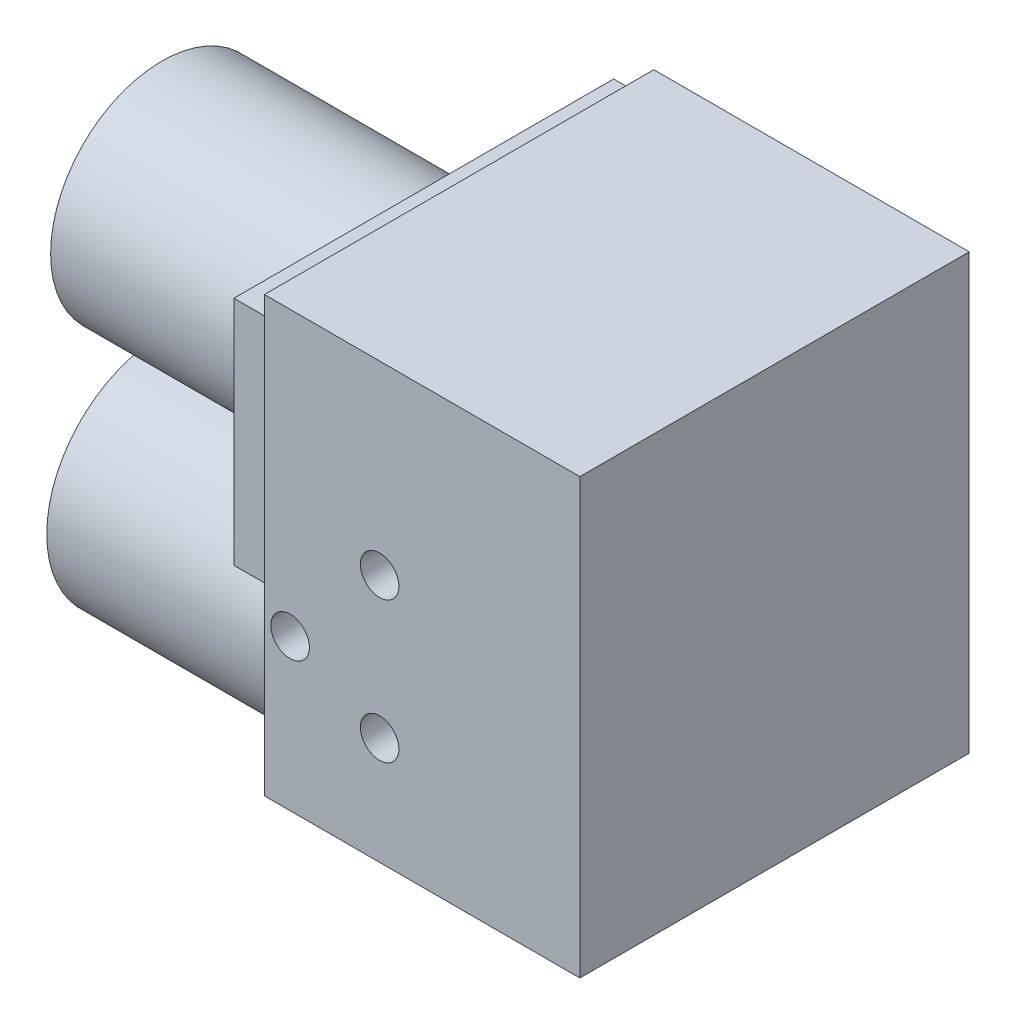
ISO-10303-21;
HEADER;
FILE_DESCRIPTION(('STEP AP214'),'2;1');
FILE_NAME('part.step','',(''),(''),'','','');
FILE_SCHEMA(('AUTOMOTIVE_DESIGN { 1 0 10303 214 1 1 1 1 }'));
ENDSEC;
DATA;
#1=APPLICATION_CONTEXT('core data for automotive mechanical design processes');
#2=APPLICATION_PROTOCOL_DEFINITION('international standard','automotive_design',2000,#1);
#3=PRODUCT_CONTEXT('',#1,'mechanical');
#4=PRODUCT('Part','Part','',(#3));
#5=PRODUCT_RELATED_PRODUCT_CATEGORY('part','',(#4));
#6=PRODUCT_DEFINITION_FORMATION('','',#4);
#7=PRODUCT_DEFINITION_CONTEXT('part definition',#1,'design');
#8=PRODUCT_DEFINITION('design','',#6,#7);
#9=PRODUCT_DEFINITION_SHAPE('','',#8);
#10=(LENGTH_UNIT() NAMED_UNIT(*) SI_UNIT(.MILLI.,.METRE.));
#11=(NAMED_UNIT(*) PLANE_ANGLE_UNIT() SI_UNIT($,.RADIAN.));
#12=(NAMED_UNIT(*) SI_UNIT($,.STERADIAN.) SOLID_ANGLE_UNIT());
#13=UNCERTAINTY_MEASURE_WITH_UNIT(LENGTH_MEASURE(1.E-05),#10,'distance_accuracy_value','');
#14=(GEOMETRIC_REPRESENTATION_CONTEXT(3) GLOBAL_UNCERTAINTY_ASSIGNED_CONTEXT((#13)) GLOBAL_UNIT_ASSIGNED_CONTEXT((#10,
#11,#12)) REPRESENTATION_CONTEXT('',''));
#15=CARTESIAN_POINT('',(0.,0.,0.));
#16=DIRECTION('',(0.,0.,1.));
#17=DIRECTION('',(1.,0.,0.));
#18=AXIS2_PLACEMENT_3D('',#15,#16,#17);
#19=CARTESIAN_POINT('',(-49.09,67.575,-65.6));
#20=DIRECTION('',(-1.,0.,0.));
#21=DIRECTION('',(0.,0.,1.));
#22=AXIS2_PLACEMENT_3D('',#19,#20,#21);
#23=PLANE('',#22);
#24=DIRECTION('',(0.,0.,1.));
#25=VECTOR('',#24,1.);
#26=CARTESIAN_POINT('',(-49.09,-67.575,-65.6));
#27=LINE('',#26,#25);
#28=CARTESIAN_POINT('',(-49.09,-67.575,-65.6));
#29=VERTEX_POINT('',#28);
#30=CARTESIAN_POINT('',(-49.09,-67.575,-31.6166490950575));
#31=VERTEX_POINT('',#30);
#32=EDGE_CURVE('E257',#29,#31,#27,.T.);
#33=ORIENTED_EDGE('',*,*,#32,.T.);
#34=CARTESIAN_POINT('',(-49.09,-50.675,0.));
#35=DIRECTION('',(-1.,0.,0.));
#36=DIRECTION('',(0.,0.,1.));
#37=AXIS2_PLACEMENT_3D('',#34,#35,#36);
#38=CIRCLE('',#37,35.85);
#39=CARTESIAN_POINT('',(-49.09,-67.575,31.6166490950575));
#40=VERTEX_POINT('',#39);
#41=EDGE_CURVE('E220',#40,#31,#38,.T.);
#42=ORIENTED_EDGE('',*,*,#41,.F.);
#43=CARTESIAN_POINT('',(-49.09,-67.575,55.6));
#44=VERTEX_POINT('',#43);
#45=EDGE_CURVE('E253',#40,#44,#27,.T.);
#46=ORIENTED_EDGE('',*,*,#45,.T.);
#47=DIRECTION('',(0.,-1.,0.));
#48=VECTOR('',#47,1.);
#49=CARTESIAN_POINT('',(-49.09,67.575,55.6));
#50=LINE('',#49,#48);
#51=CARTESIAN_POINT('',(-49.09,67.575,55.6));
#52=VERTEX_POINT('',#51);
#53=EDGE_CURVE('E230',#52,#44,#50,.T.);
#54=ORIENTED_EDGE('',*,*,#53,.F.);
#55=DIRECTION('',(0.,0.,1.));
#56=VECTOR('',#55,1.);
#57=CARTESIAN_POINT('',(-49.09,67.575,-65.6));
#58=LINE('',#57,#56);
#59=CARTESIAN_POINT('',(-49.09,67.575,-65.6));
#60=VERTEX_POINT('',#59);
#61=EDGE_CURVE('E11',#60,#52,#58,.T.);
#62=ORIENTED_EDGE('',*,*,#61,.F.);
#63=DIRECTION('',(0.,-1.,0.));
#64=VECTOR('',#63,1.);
#65=CARTESIAN_POINT('',(-49.09,67.575,-65.6));
#66=LINE('',#65,#64);
#67=EDGE_CURVE('E242',#60,#29,#66,.T.);
#68=ORIENTED_EDGE('',*,*,#67,.T.);
#69=EDGE_LOOP('',(#33,#42,#46,#54,#62,#68));
#70=FACE_BOUND('',#69,.T.);
#71=DIRECTION('',(0.,0.,1.));
#72=VECTOR('',#71,1.);
#73=CARTESIAN_POINT('',(-49.09,-11.675,-64.1));
#74=LINE('',#73,#72);
#75=CARTESIAN_POINT('',(-49.09,-11.675,-64.1));
#76=VERTEX_POINT('',#75);
#77=CARTESIAN_POINT('',(-49.09,-11.675,54.1));
#78=VERTEX_POINT('',#77);
#79=EDGE_CURVE('E177',#76,#78,#74,.T.);
#80=ORIENTED_EDGE('',*,*,#79,.F.);
#81=DIRECTION('',(0.,-1.,0.));
#82=VECTOR('',#81,1.);
#83=CARTESIAN_POINT('',(-49.09,60.325,-64.1));
#84=LINE('',#83,#82);
#85=CARTESIAN_POINT('',(-49.09,60.325,-64.1));
#86=VERTEX_POINT('',#85);
#87=EDGE_CURVE('E163',#86,#76,#84,.T.);
#88=ORIENTED_EDGE('',*,*,#87,.F.);
#89=DIRECTION('',(0.,0.,-1.));
#90=VECTOR('',#89,1.);
#91=CARTESIAN_POINT('',(-49.09,60.325,-64.1));
#92=LINE('',#91,#90);
#93=CARTESIAN_POINT('',(-49.09,60.325,54.1));
#94=VERTEX_POINT('',#93);
#95=EDGE_CURVE('E168',#94,#86,#92,.T.);
#96=ORIENTED_EDGE('',*,*,#95,.F.);
#97=DIRECTION('',(0.,1.,0.));
#98=VECTOR('',#97,1.);
#99=CARTESIAN_POINT('',(-49.09,60.325,54.1));
#100=LINE('',#99,#98);
#101=EDGE_CURVE('E179',#78,#94,#100,.T.);
#102=ORIENTED_EDGE('',*,*,#101,.F.);
#103=EDGE_LOOP('',(#80,#88,#96,#102));
#104=FACE_BOUND('',#103,.T.);
#105=ADVANCED_FACE('F33',(#70,#104),#23,.T.);
#106=CARTESIAN_POINT('',(-49.09,67.575,-65.6));
#107=DIRECTION('',(0.,1.,0.));
#108=DIRECTION('',(-1.,0.,0.));
#109=AXIS2_PLACEMENT_3D('',#106,#107,#108);
#110=PLANE('',#109);
#111=ORIENTED_EDGE('',*,*,#61,.T.);
#112=DIRECTION('',(-1.,0.,0.));
#113=VECTOR('',#112,1.);
#114=CARTESIAN_POINT('',(-49.09,67.575,55.6));
#115=LINE('',#114,#113);
#116=CARTESIAN_POINT('',(49.09,67.575,55.6));
#117=VERTEX_POINT('',#116);
#118=EDGE_CURVE('E239',#117,#52,#115,.T.);
#119=ORIENTED_EDGE('',*,*,#118,.F.);
#120=DIRECTION('',(0.,0.,1.));
#121=VECTOR('',#120,1.);
#122=CARTESIAN_POINT('',(49.09,67.575,-65.6));
#123=LINE('',#122,#121);
#124=CARTESIAN_POINT('',(49.09,67.575,-65.6));
#125=VERTEX_POINT('',#124);
#126=EDGE_CURVE('E41',#125,#117,#123,.T.);
#127=ORIENTED_EDGE('',*,*,#126,.F.);
#128=DIRECTION('',(-1.,0.,0.));
#129=VECTOR('',#128,1.);
#130=CARTESIAN_POINT('',(-49.09,67.575,-65.6));
#131=LINE('',#130,#129);
#132=EDGE_CURVE('E251',#125,#60,#131,.T.);
#133=ORIENTED_EDGE('',*,*,#132,.T.);
#134=EDGE_LOOP('',(#111,#119,#127,#133));
#135=FACE_BOUND('',#134,.T.);
#136=ADVANCED_FACE('F270',(#135),#110,.T.);
#137=CARTESIAN_POINT('',(49.09,67.575,-65.6));
#138=DIRECTION('',(1.,0.,0.));
#139=DIRECTION('',(0.,1.,0.));
#140=AXIS2_PLACEMENT_3D('',#137,#138,#139);
#141=PLANE('',#140);
#142=ORIENTED_EDGE('',*,*,#126,.T.);
#143=DIRECTION('',(0.,1.,0.));
#144=VECTOR('',#143,1.);
#145=CARTESIAN_POINT('',(49.09,67.575,55.6));
#146=LINE('',#145,#144);
#147=CARTESIAN_POINT('',(49.09,-67.575,55.6));
#148=VERTEX_POINT('',#147);
#149=EDGE_CURVE('E236',#148,#117,#146,.T.);
#150=ORIENTED_EDGE('',*,*,#149,.F.);
#151=DIRECTION('',(0.,0.,1.));
#152=VECTOR('',#151,1.);
#153=CARTESIAN_POINT('',(49.09,-67.575,-65.6));
#154=LINE('',#153,#152);
#155=CARTESIAN_POINT('',(49.09,-67.575,-65.6));
#156=VERTEX_POINT('',#155);
#157=EDGE_CURVE('E256',#156,#148,#154,.T.);
#158=ORIENTED_EDGE('',*,*,#157,.F.);
#159=DIRECTION('',(0.,1.,0.));
#160=VECTOR('',#159,1.);
#161=CARTESIAN_POINT('',(49.09,67.575,-65.6));
#162=LINE('',#161,#160);
#163=EDGE_CURVE('E248',#156,#125,#162,.T.);
#164=ORIENTED_EDGE('',*,*,#163,.T.);
#165=EDGE_LOOP('',(#142,#150,#158,#164));
#166=FACE_BOUND('',#165,.T.);
#167=ADVANCED_FACE('F278',(#166),#141,.T.);
#168=CARTESIAN_POINT('',(-49.09,-67.575,-65.6));
#169=DIRECTION('',(0.,-1.,0.));
#170=DIRECTION('',(0.,0.,-1.));
#171=AXIS2_PLACEMENT_3D('',#168,#169,#170);
#172=PLANE('',#171);
#173=CARTESIAN_POINT('',(-32.79,-67.575,35.1));
#174=DIRECTION('',(0.,-1.,0.));
#175=DIRECTION('',(0.,0.,-1.));
#176=AXIS2_PLACEMENT_3D('',#173,#174,#175);
#177=CIRCLE('',#176,5.25);
#178=CARTESIAN_POINT('',(-32.79,-67.575,29.85));
#179=VERTEX_POINT('',#178);
#180=EDGE_CURVE('E190',#179,#179,#177,.T.);
#181=ORIENTED_EDGE('',*,*,#180,.F.);
#182=EDGE_LOOP('',(#181));
#183=FACE_BOUND('',#182,.T.);
#184=CARTESIAN_POINT('',(-36.39,-67.575,-57.2));
#185=DIRECTION('',(0.,-1.,0.));
#186=DIRECTION('',(0.,0.,-1.));
#187=AXIS2_PLACEMENT_3D('',#184,#185,#186);
#188=CIRCLE('',#187,5.25);
#189=CARTESIAN_POINT('',(-36.39,-67.575,-62.45));
#190=VERTEX_POINT('',#189);
#191=EDGE_CURVE('E196',#190,#190,#188,.T.);
#192=ORIENTED_EDGE('',*,*,#191,.F.);
#193=EDGE_LOOP('',(#192));
#194=FACE_BOUND('',#193,.T.);
#195=ORIENTED_EDGE('',*,*,#157,.T.);
#196=DIRECTION('',(1.,0.,0.));
#197=VECTOR('',#196,1.);
#198=CARTESIAN_POINT('',(-49.09,-67.575,55.6));
#199=LINE('',#198,#197);
#200=EDGE_CURVE('E233',#44,#148,#199,.T.);
#201=ORIENTED_EDGE('',*,*,#200,.F.);
#202=ORIENTED_EDGE('',*,*,#45,.F.);
#203=EDGE_CURVE('E57',#31,#40,#27,.T.);
#204=ORIENTED_EDGE('',*,*,#203,.F.);
#205=ORIENTED_EDGE('',*,*,#32,.F.);
#206=DIRECTION('',(1.,0.,0.));
#207=VECTOR('',#206,1.);
#208=CARTESIAN_POINT('',(-49.09,-67.575,-65.6));
#209=LINE('',#208,#207);
#210=EDGE_CURVE('E245',#29,#156,#209,.T.);
#211=ORIENTED_EDGE('',*,*,#210,.T.);
#212=EDGE_LOOP('',(#195,#201,#202,#204,#205,#211));
#213=FACE_BOUND('',#212,.T.);
#214=ADVANCED_FACE('F264',(#183,#194,#213),#172,.T.);
#215=CARTESIAN_POINT('',(0.,0.,-65.6));
#216=DIRECTION('',(0.,0.,1.));
#217=DIRECTION('',(1.,0.,0.));
#218=AXIS2_PLACEMENT_3D('',#215,#216,#217);
#219=PLANE('',#218);
#220=ORIENTED_EDGE('',*,*,#67,.F.);
#221=ORIENTED_EDGE('',*,*,#132,.F.);
#222=ORIENTED_EDGE('',*,*,#163,.F.);
#223=ORIENTED_EDGE('',*,*,#210,.F.);
#224=EDGE_LOOP('',(#220,#221,#222,#223));
#225=FACE_BOUND('',#224,.T.);
#226=ADVANCED_FACE('F275',(#225),#219,.F.);
#227=CARTESIAN_POINT('',(0.,0.,55.6));
#228=DIRECTION('',(0.,0.,1.));
#229=DIRECTION('',(1.,0.,0.));
#230=AXIS2_PLACEMENT_3D('',#227,#228,#229);
#231=PLANE('',#230);
#232=CARTESIAN_POINT('',(-13.23,9.82500000000001,55.6));
#233=DIRECTION('',(0.,0.,1.));
#234=DIRECTION('',(1.,0.,0.));
#235=AXIS2_PLACEMENT_3D('',#232,#233,#234);
#236=CIRCLE('',#235,6.);
#237=CARTESIAN_POINT('',(-7.23000000000002,9.82500000000001,55.6));
#238=VERTEX_POINT('',#237);
#239=EDGE_CURVE('E202',#238,#238,#236,.T.);
#240=ORIENTED_EDGE('',*,*,#239,.F.);
#241=EDGE_LOOP('',(#240));
#242=FACE_BOUND('',#241,.T.);
#243=CARTESIAN_POINT('',(-13.23,-34.075,55.6));
#244=DIRECTION('',(0.,0.,1.));
#245=DIRECTION('',(1.,0.,0.));
#246=AXIS2_PLACEMENT_3D('',#243,#244,#245);
#247=CIRCLE('',#246,6.);
#248=CARTESIAN_POINT('',(-7.23000000000002,-34.075,55.6));
#249=VERTEX_POINT('',#248);
#250=EDGE_CURVE('E208',#249,#249,#247,.T.);
#251=ORIENTED_EDGE('',*,*,#250,.F.);
#252=EDGE_LOOP('',(#251));
#253=FACE_BOUND('',#252,.T.);
#254=CARTESIAN_POINT('',(-41.09,-20.575,55.6));
#255=DIRECTION('',(0.,0.,1.));
#256=DIRECTION('',(1.,0.,0.));
#257=AXIS2_PLACEMENT_3D('',#254,#255,#256);
#258=CIRCLE('',#257,6.);
#259=CARTESIAN_POINT('',(-35.09,-20.575,55.6));
#260=VERTEX_POINT('',#259);
#261=EDGE_CURVE('E214',#260,#260,#258,.T.);
#262=ORIENTED_EDGE('',*,*,#261,.F.);
#263=EDGE_LOOP('',(#262));
#264=FACE_BOUND('',#263,.T.);
#265=ORIENTED_EDGE('',*,*,#53,.T.);
#266=ORIENTED_EDGE('',*,*,#200,.T.);
#267=ORIENTED_EDGE('',*,*,#149,.T.);
#268=ORIENTED_EDGE('',*,*,#118,.T.);
#269=EDGE_LOOP('',(#265,#266,#267,#268));
#270=FACE_BOUND('',#269,.T.);
#271=ADVANCED_FACE('F267',(#242,#253,#264,#270),#231,.T.);
#272=CARTESIAN_POINT('',(-136.59,-50.675,0.));
#273=DIRECTION('',(1.,0.,0.));
#274=DIRECTION('',(0.,0.,-1.));
#275=AXIS2_PLACEMENT_3D('',#272,#273,#274);
#276=CYLINDRICAL_SURFACE('',#275,35.85);
#277=CARTESIAN_POINT('',(-136.59,-50.675,0.));
#278=DIRECTION('',(-1.,0.,0.));
#279=DIRECTION('',(0.,0.,1.));
#280=AXIS2_PLACEMENT_3D('',#277,#278,#279);
#281=CIRCLE('',#280,35.85);
#282=CARTESIAN_POINT('',(-136.59,-50.675,35.85));
#283=VERTEX_POINT('',#282);
#284=EDGE_CURVE('E221',#283,#283,#281,.T.);
#285=ORIENTED_EDGE('',*,*,#284,.F.);
#286=EDGE_LOOP('',(#285));
#287=FACE_BOUND('',#286,.T.);
#288=EDGE_CURVE('E225',#31,#40,#38,.T.);
#289=ORIENTED_EDGE('',*,*,#288,.T.);
#290=ORIENTED_EDGE('',*,*,#41,.T.);
#291=EDGE_LOOP('',(#289,#290));
#292=FACE_BOUND('',#291,.T.);
#293=ADVANCED_FACE('F332',(#287,#292),#276,.T.);
#294=CARTESIAN_POINT('',(-136.59,-50.675,0.));
#295=DIRECTION('',(-1.,0.,0.));
#296=DIRECTION('',(0.,0.,1.));
#297=AXIS2_PLACEMENT_3D('',#294,#295,#296);
#298=PLANE('',#297);
#299=ORIENTED_EDGE('',*,*,#284,.T.);
#300=EDGE_LOOP('',(#299));
#301=FACE_BOUND('',#300,.T.);
#302=ADVANCED_FACE('F336',(#301),#298,.T.);
#303=CARTESIAN_POINT('',(-49.09,-50.675,0.));
#304=DIRECTION('',(-1.,0.,0.));
#305=DIRECTION('',(0.,0.,1.));
#306=AXIS2_PLACEMENT_3D('',#303,#304,#305);
#307=PLANE('',#306);
#308=ORIENTED_EDGE('',*,*,#203,.T.);
#309=ORIENTED_EDGE('',*,*,#288,.F.);
#310=EDGE_LOOP('',(#308,#309));
#311=FACE_BOUND('',#310,.T.);
#312=ADVANCED_FACE('F346',(#311),#307,.F.);
#313=CARTESIAN_POINT('',(-41.09,-20.575,36.04));
#314=DIRECTION('',(0.,0.,1.));
#315=DIRECTION('',(1.,0.,0.));
#316=AXIS2_PLACEMENT_3D('',#313,#314,#315);
#317=CONICAL_SURFACE('',#316,5.99999999999999,1.02974425867665);
#318=CARTESIAN_POINT('',(-41.09,-20.575,32.4348362858346));
#319=VERTEX_POINT('',#318);
#320=VERTEX_LOOP('',#319);
#321=FACE_BOUND('',#320,.T.);
#322=CARTESIAN_POINT('',(-41.09,-20.575,36.04));
#323=DIRECTION('',(0.,0.,1.));
#324=DIRECTION('',(1.,0.,0.));
#325=AXIS2_PLACEMENT_3D('',#322,#323,#324);
#326=CIRCLE('',#325,5.99999999999999);
#327=CARTESIAN_POINT('',(-35.09,-20.575,36.04));
#328=VERTEX_POINT('',#327);
#329=EDGE_CURVE('E217',#328,#328,#326,.T.);
#330=ORIENTED_EDGE('',*,*,#329,.T.);
#331=EDGE_LOOP('',(#330));
#332=FACE_BOUND('',#331,.T.);
#333=ADVANCED_FACE('F356',(#321,#332),#317,.F.);
#334=CARTESIAN_POINT('',(-41.09,-20.575,55.6));
#335=DIRECTION('',(0.,0.,1.));
#336=DIRECTION('',(1.,0.,0.));
#337=AXIS2_PLACEMENT_3D('',#334,#335,#336);
#338=CYLINDRICAL_SURFACE('',#337,5.99999999999999);
#339=ORIENTED_EDGE('',*,*,#329,.F.);
#340=EDGE_LOOP('',(#339));
#341=FACE_BOUND('',#340,.T.);
#342=ORIENTED_EDGE('',*,*,#261,.T.);
#343=EDGE_LOOP('',(#342));
#344=FACE_BOUND('',#343,.T.);
#345=ADVANCED_FACE('F373',(#341,#344),#338,.F.);
#346=CARTESIAN_POINT('',(-13.23,-34.075,36.04));
#347=DIRECTION('',(0.,0.,1.));
#348=DIRECTION('',(1.,0.,0.));
#349=AXIS2_PLACEMENT_3D('',#346,#347,#348);
#350=CONICAL_SURFACE('',#349,5.99999999999999,1.02974425867665);
#351=CARTESIAN_POINT('',(-13.23,-34.075,32.4348362858346));
#352=VERTEX_POINT('',#351);
#353=VERTEX_LOOP('',#352);
#354=FACE_BOUND('',#353,.T.);
#355=CARTESIAN_POINT('',(-13.23,-34.075,36.04));
#356=DIRECTION('',(0.,0.,1.));
#357=DIRECTION('',(1.,0.,0.));
#358=AXIS2_PLACEMENT_3D('',#355,#356,#357);
#359=CIRCLE('',#358,5.99999999999999);
#360=CARTESIAN_POINT('',(-7.23000000000002,-34.075,36.04));
#361=VERTEX_POINT('',#360);
#362=EDGE_CURVE('E211',#361,#361,#359,.T.);
#363=ORIENTED_EDGE('',*,*,#362,.T.);
#364=EDGE_LOOP('',(#363));
#365=FACE_BOUND('',#364,.T.);
#366=ADVANCED_FACE('F383',(#354,#365),#350,.F.);
#367=CARTESIAN_POINT('',(-13.23,-34.075,55.6));
#368=DIRECTION('',(0.,0.,1.));
#369=DIRECTION('',(1.,0.,0.));
#370=AXIS2_PLACEMENT_3D('',#367,#368,#369);
#371=CYLINDRICAL_SURFACE('',#370,6.);
#372=ORIENTED_EDGE('',*,*,#362,.F.);
#373=EDGE_LOOP('',(#372));
#374=FACE_BOUND('',#373,.T.);
#375=ORIENTED_EDGE('',*,*,#250,.T.);
#376=EDGE_LOOP('',(#375));
#377=FACE_BOUND('',#376,.T.);
#378=ADVANCED_FACE('F393',(#374,#377),#371,.F.);
#379=CARTESIAN_POINT('',(-13.23,9.82500000000001,36.04));
#380=DIRECTION('',(0.,0.,1.));
#381=DIRECTION('',(1.,0.,0.));
#382=AXIS2_PLACEMENT_3D('',#379,#380,#381);
#383=CONICAL_SURFACE('',#382,5.99999999999999,1.02974425867665);
#384=CARTESIAN_POINT('',(-13.23,9.82500000000001,32.4348362858346));
#385=VERTEX_POINT('',#384);
#386=VERTEX_LOOP('',#385);
#387=FACE_BOUND('',#386,.T.);
#388=CARTESIAN_POINT('',(-13.23,9.82500000000001,36.04));
#389=DIRECTION('',(0.,0.,1.));
#390=DIRECTION('',(1.,0.,0.));
#391=AXIS2_PLACEMENT_3D('',#388,#389,#390);
#392=CIRCLE('',#391,5.99999999999999);
#393=CARTESIAN_POINT('',(-7.23000000000002,9.82500000000001,36.04));
#394=VERTEX_POINT('',#393);
#395=EDGE_CURVE('E205',#394,#394,#392,.T.);
#396=ORIENTED_EDGE('',*,*,#395,.T.);
#397=EDGE_LOOP('',(#396));
#398=FACE_BOUND('',#397,.T.);
#399=ADVANCED_FACE('F403',(#387,#398),#383,.F.);
#400=CARTESIAN_POINT('',(-13.23,9.82500000000001,55.6));
#401=DIRECTION('',(0.,0.,1.));
#402=DIRECTION('',(1.,0.,0.));
#403=AXIS2_PLACEMENT_3D('',#400,#401,#402);
#404=CYLINDRICAL_SURFACE('',#403,6.);
#405=ORIENTED_EDGE('',*,*,#395,.F.);
#406=EDGE_LOOP('',(#405));
#407=FACE_BOUND('',#406,.T.);
#408=ORIENTED_EDGE('',*,*,#239,.T.);
#409=EDGE_LOOP('',(#408));
#410=FACE_BOUND('',#409,.T.);
#411=ADVANCED_FACE('F413',(#407,#410),#404,.F.);
#412=CARTESIAN_POINT('',(-36.39,-48.015,-57.2));
#413=DIRECTION('',(0.,-1.,0.));
#414=DIRECTION('',(0.,0.,-1.));
#415=AXIS2_PLACEMENT_3D('',#412,#413,#414);
#416=CONICAL_SURFACE('',#415,5.24999999999999,1.02974425867665);
#417=CARTESIAN_POINT('',(-36.39,-44.8604817501053,-57.2));
#418=VERTEX_POINT('',#417);
#419=VERTEX_LOOP('',#418);
#420=FACE_BOUND('',#419,.T.);
#421=CARTESIAN_POINT('',(-36.39,-48.015,-57.2));
#422=DIRECTION('',(0.,-1.,0.));
#423=DIRECTION('',(0.,0.,-1.));
#424=AXIS2_PLACEMENT_3D('',#421,#422,#423);
#425=CIRCLE('',#424,5.24999999999999);
#426=CARTESIAN_POINT('',(-36.39,-48.015,-62.45));
#427=VERTEX_POINT('',#426);
#428=EDGE_CURVE('E199',#427,#427,#425,.T.);
#429=ORIENTED_EDGE('',*,*,#428,.T.);
#430=EDGE_LOOP('',(#429));
#431=FACE_BOUND('',#430,.T.);
#432=ADVANCED_FACE('F423',(#420,#431),#416,.F.);
#433=CARTESIAN_POINT('',(-36.39,-67.575,-57.2));
#434=DIRECTION('',(0.,-1.,0.));
#435=DIRECTION('',(0.,0.,-1.));
#436=AXIS2_PLACEMENT_3D('',#433,#434,#435);
#437=CYLINDRICAL_SURFACE('',#436,5.25);
#438=ORIENTED_EDGE('',*,*,#428,.F.);
#439=EDGE_LOOP('',(#438));
#440=FACE_BOUND('',#439,.T.);
#441=ORIENTED_EDGE('',*,*,#191,.T.);
#442=EDGE_LOOP('',(#441));
#443=FACE_BOUND('',#442,.T.);
#444=ADVANCED_FACE('F438',(#440,#443),#437,.F.);
#445=CARTESIAN_POINT('',(-32.79,-48.015,35.1));
#446=DIRECTION('',(0.,-1.,0.));
#447=DIRECTION('',(0.,0.,-1.));
#448=AXIS2_PLACEMENT_3D('',#445,#446,#447);
#449=CONICAL_SURFACE('',#448,5.24999999999999,1.02974425867665);
#450=CARTESIAN_POINT('',(-32.79,-44.8604817501053,35.1));
#451=VERTEX_POINT('',#450);
#452=VERTEX_LOOP('',#451);
#453=FACE_BOUND('',#452,.T.);
#454=CARTESIAN_POINT('',(-32.79,-48.015,35.1));
#455=DIRECTION('',(0.,-1.,0.));
#456=DIRECTION('',(0.,0.,-1.));
#457=AXIS2_PLACEMENT_3D('',#454,#455,#456);
#458=CIRCLE('',#457,5.24999999999999);
#459=CARTESIAN_POINT('',(-32.79,-48.015,29.85));
#460=VERTEX_POINT('',#459);
#461=EDGE_CURVE('E193',#460,#460,#458,.T.);
#462=ORIENTED_EDGE('',*,*,#461,.T.);
#463=EDGE_LOOP('',(#462));
#464=FACE_BOUND('',#463,.T.);
#465=ADVANCED_FACE('F448',(#453,#464),#449,.F.);
#466=CARTESIAN_POINT('',(-32.79,-67.575,35.1));
#467=DIRECTION('',(0.,-1.,0.));
#468=DIRECTION('',(0.,0.,-1.));
#469=AXIS2_PLACEMENT_3D('',#466,#467,#468);
#470=CYLINDRICAL_SURFACE('',#469,5.25);
#471=ORIENTED_EDGE('',*,*,#461,.F.);
#472=EDGE_LOOP('',(#471));
#473=FACE_BOUND('',#472,.T.);
#474=ORIENTED_EDGE('',*,*,#180,.T.);
#475=EDGE_LOOP('',(#474));
#476=FACE_BOUND('',#475,.T.);
#477=ADVANCED_FACE('F457',(#473,#476),#470,.F.);
#478=CARTESIAN_POINT('',(-60.09,60.325,-64.1));
#479=DIRECTION('',(0.,0.,1.));
#480=DIRECTION('',(0.,-1.,0.));
#481=AXIS2_PLACEMENT_3D('',#478,#479,#480);
#482=PLANE('',#481);
#483=ORIENTED_EDGE('',*,*,#87,.T.);
#484=DIRECTION('',(1.,0.,0.));
#485=VECTOR('',#484,1.);
#486=CARTESIAN_POINT('',(-60.09,-11.675,-64.1));
#487=LINE('',#486,#485);
#488=CARTESIAN_POINT('',(-60.09,-11.675,-64.1));
#489=VERTEX_POINT('',#488);
#490=EDGE_CURVE('E188',#489,#76,#487,.T.);
#491=ORIENTED_EDGE('',*,*,#490,.F.);
#492=DIRECTION('',(0.,-1.,0.));
#493=VECTOR('',#492,1.);
#494=CARTESIAN_POINT('',(-60.09,60.325,-64.1));
#495=LINE('',#494,#493);
#496=CARTESIAN_POINT('',(-60.09,60.325,-64.1));
#497=VERTEX_POINT('',#496);
#498=EDGE_CURVE('E164',#497,#489,#495,.T.);
#499=ORIENTED_EDGE('',*,*,#498,.F.);
#500=DIRECTION('',(1.,0.,0.));
#501=VECTOR('',#500,1.);
#502=CARTESIAN_POINT('',(-60.09,60.325,-64.1));
#503=LINE('',#502,#501);
#504=EDGE_CURVE('E174',#497,#86,#503,.T.);
#505=ORIENTED_EDGE('',*,*,#504,.T.);
#506=EDGE_LOOP('',(#483,#491,#499,#505));
#507=FACE_BOUND('',#506,.T.);
#508=ADVANCED_FACE('F466',(#507),#482,.F.);
#509=CARTESIAN_POINT('',(-60.09,-11.675,-64.1));
#510=DIRECTION('',(0.,1.,0.));
#511=DIRECTION('',(0.,0.,1.));
#512=AXIS2_PLACEMENT_3D('',#509,#510,#511);
#513=PLANE('',#512);
#514=ORIENTED_EDGE('',*,*,#79,.T.);
#515=DIRECTION('',(1.,0.,0.));
#516=VECTOR('',#515,1.);
#517=CARTESIAN_POINT('',(-60.09,-11.675,54.1));
#518=LINE('',#517,#516);
#519=CARTESIAN_POINT('',(-60.09,-11.675,54.1));
#520=VERTEX_POINT('',#519);
#521=EDGE_CURVE('E185',#520,#78,#518,.T.);
#522=ORIENTED_EDGE('',*,*,#521,.F.);
#523=DIRECTION('',(0.,0.,1.));
#524=VECTOR('',#523,1.);
#525=CARTESIAN_POINT('',(-60.09,-11.675,-64.1));
#526=LINE('',#525,#524);
#527=EDGE_CURVE('E167',#489,#520,#526,.T.);
#528=ORIENTED_EDGE('',*,*,#527,.F.);
#529=ORIENTED_EDGE('',*,*,#490,.T.);
#530=EDGE_LOOP('',(#514,#522,#528,#529));
#531=FACE_BOUND('',#530,.T.);
#532=ADVANCED_FACE('F475',(#531),#513,.F.);
#533=CARTESIAN_POINT('',(-60.09,60.325,54.1));
#534=DIRECTION('',(0.,0.,-1.));
#535=DIRECTION('',(0.,1.,0.));
#536=AXIS2_PLACEMENT_3D('',#533,#534,#535);
#537=PLANE('',#536);
#538=ORIENTED_EDGE('',*,*,#101,.T.);
#539=DIRECTION('',(1.,0.,0.));
#540=VECTOR('',#539,1.);
#541=CARTESIAN_POINT('',(-60.09,60.325,54.1));
#542=LINE('',#541,#540);
#543=CARTESIAN_POINT('',(-60.09,60.325,54.1));
#544=VERTEX_POINT('',#543);
#545=EDGE_CURVE('E49',#544,#94,#542,.T.);
#546=ORIENTED_EDGE('',*,*,#545,.F.);
#547=DIRECTION('',(0.,1.,0.));
#548=VECTOR('',#547,1.);
#549=CARTESIAN_POINT('',(-60.09,60.325,54.1));
#550=LINE('',#549,#548);
#551=EDGE_CURVE('E170',#520,#544,#550,.T.);
#552=ORIENTED_EDGE('',*,*,#551,.F.);
#553=ORIENTED_EDGE('',*,*,#521,.T.);
#554=EDGE_LOOP('',(#538,#546,#552,#553));
#555=FACE_BOUND('',#554,.T.);
#556=ADVANCED_FACE('F483',(#555),#537,.F.);
#557=CARTESIAN_POINT('',(-60.09,60.325,-64.1));
#558=DIRECTION('',(0.,-1.,0.));
#559=DIRECTION('',(0.,0.,-1.));
#560=AXIS2_PLACEMENT_3D('',#557,#558,#559);
#561=PLANE('',#560);
#562=ORIENTED_EDGE('',*,*,#95,.T.);
#563=ORIENTED_EDGE('',*,*,#504,.F.);
#564=DIRECTION('',(0.,0.,-1.));
#565=VECTOR('',#564,1.);
#566=CARTESIAN_POINT('',(-60.09,60.325,-64.1));
#567=LINE('',#566,#565);
#568=EDGE_CURVE('E172',#544,#497,#567,.T.);
#569=ORIENTED_EDGE('',*,*,#568,.F.);
#570=ORIENTED_EDGE('',*,*,#545,.T.);
#571=EDGE_LOOP('',(#562,#563,#569,#570));
#572=FACE_BOUND('',#571,.T.);
#573=ADVANCED_FACE('F491',(#572),#561,.F.);
#574=CARTESIAN_POINT('',(-60.09,0.,0.));
#575=DIRECTION('',(-1.,0.,0.));
#576=DIRECTION('',(0.,0.,1.));
#577=AXIS2_PLACEMENT_3D('',#574,#575,#576);
#578=PLANE('',#577);
#579=CARTESIAN_POINT('',(-60.09,52.175,-49.6));
#580=DIRECTION('',(-1.,0.,0.));
#581=DIRECTION('',(0.,0.,1.));
#582=AXIS2_PLACEMENT_3D('',#579,#580,#581);
#583=CIRCLE('',#582,5.24999999999999);
#584=CARTESIAN_POINT('',(-60.09,52.175,-44.35));
#585=VERTEX_POINT('',#584);
#586=EDGE_CURVE('E141',#585,#585,#583,.T.);
#587=ORIENTED_EDGE('',*,*,#586,.F.);
#588=EDGE_LOOP('',(#587));
#589=FACE_BOUND('',#588,.T.);
#590=CARTESIAN_POINT('',(-60.09,6.075,-55.1));
#591=DIRECTION('',(-1.,0.,0.));
#592=DIRECTION('',(0.,0.,1.));
#593=AXIS2_PLACEMENT_3D('',#590,#591,#592);
#594=CIRCLE('',#593,5.24999999999999);
#595=CARTESIAN_POINT('',(-60.09,6.075,-49.85));
#596=VERTEX_POINT('',#595);
#597=EDGE_CURVE('E140',#596,#596,#594,.T.);
#598=ORIENTED_EDGE('',*,*,#597,.F.);
#599=EDGE_LOOP('',(#598));
#600=FACE_BOUND('',#599,.T.);
#601=CARTESIAN_POINT('',(-60.09,6.075,45.1));
#602=DIRECTION('',(-1.,0.,0.));
#603=DIRECTION('',(0.,0.,1.));
#604=AXIS2_PLACEMENT_3D('',#601,#602,#603);
#605=CIRCLE('',#604,5.24999999999999);
#606=CARTESIAN_POINT('',(-60.09,6.075,50.35));
#607=VERTEX_POINT('',#606);
#608=EDGE_CURVE('E151',#607,#607,#605,.T.);
#609=ORIENTED_EDGE('',*,*,#608,.F.);
#610=EDGE_LOOP('',(#609));
#611=FACE_BOUND('',#610,.T.);
#612=CARTESIAN_POINT('',(-60.09,52.175,39.6));
#613=DIRECTION('',(-1.,0.,0.));
#614=DIRECTION('',(0.,0.,1.));
#615=AXIS2_PLACEMENT_3D('',#612,#613,#614);
#616=CIRCLE('',#615,5.24999999999999);
#617=CARTESIAN_POINT('',(-60.09,52.175,44.85));
#618=VERTEX_POINT('',#617);
#619=EDGE_CURVE('E157',#618,#618,#616,.T.);
#620=ORIENTED_EDGE('',*,*,#619,.F.);
#621=EDGE_LOOP('',(#620));
#622=FACE_BOUND('',#621,.T.);
#623=CARTESIAN_POINT('',(-60.09,24.325,0.));
#624=DIRECTION('',(-1.,0.,0.));
#625=DIRECTION('',(0.,0.,1.));
#626=AXIS2_PLACEMENT_3D('',#623,#624,#625);
#627=CIRCLE('',#626,34.65);
#628=CARTESIAN_POINT('',(-60.09,24.325,34.65));
#629=VERTEX_POINT('',#628);
#630=EDGE_CURVE('E36',#629,#629,#627,.T.);
#631=ORIENTED_EDGE('',*,*,#630,.F.);
#632=EDGE_LOOP('',(#631));
#633=FACE_BOUND('',#632,.T.);
#634=ORIENTED_EDGE('',*,*,#498,.T.);
#635=ORIENTED_EDGE('',*,*,#527,.T.);
#636=ORIENTED_EDGE('',*,*,#551,.T.);
#637=ORIENTED_EDGE('',*,*,#568,.T.);
#638=EDGE_LOOP('',(#634,#635,#636,#637));
#639=FACE_BOUND('',#638,.T.);
#640=ADVANCED_FACE('F322',(#589,#600,#611,#622,#633,#639),#578,.T.);
#641=CARTESIAN_POINT('',(-136.59,24.325,0.));
#642=DIRECTION('',(-1.,0.,0.));
#643=DIRECTION('',(0.,0.,1.));
#644=AXIS2_PLACEMENT_3D('',#641,#642,#643);
#645=PLANE('',#644);
#646=CARTESIAN_POINT('',(-136.59,24.325,0.));
#647=DIRECTION('',(-1.,0.,0.));
#648=DIRECTION('',(0.,0.,1.));
#649=AXIS2_PLACEMENT_3D('',#646,#647,#648);
#650=CIRCLE('',#649,34.65);
#651=CARTESIAN_POINT('',(-136.59,24.325,34.65));
#652=VERTEX_POINT('',#651);
#653=EDGE_CURVE('E224',#652,#652,#650,.T.);
#654=ORIENTED_EDGE('',*,*,#653,.T.);
#655=EDGE_LOOP('',(#654));
#656=FACE_BOUND('',#655,.T.);
#657=ADVANCED_FACE('F316',(#656),#645,.T.);
#658=CARTESIAN_POINT('',(-136.59,24.325,0.));
#659=DIRECTION('',(1.,0.,0.));
#660=DIRECTION('',(0.,0.,-1.));
#661=AXIS2_PLACEMENT_3D('',#658,#659,#660);
#662=CYLINDRICAL_SURFACE('',#661,34.65);
#663=ORIENTED_EDGE('',*,*,#630,.T.);
#664=EDGE_LOOP('',(#663));
#665=FACE_BOUND('',#664,.T.);
#666=ORIENTED_EDGE('',*,*,#653,.F.);
#667=EDGE_LOOP('',(#666));
#668=FACE_BOUND('',#667,.T.);
#669=ADVANCED_FACE('F321',(#665,#668),#662,.T.);
#670=CARTESIAN_POINT('',(-40.53,52.175,39.6));
#671=DIRECTION('',(-1.,0.,0.));
#672=DIRECTION('',(0.,0.,1.));
#673=AXIS2_PLACEMENT_3D('',#670,#671,#672);
#674=CONICAL_SURFACE('',#673,5.24999999999998,1.02974425867665);
#675=CARTESIAN_POINT('',(-37.3754817501053,52.175,39.6));
#676=VERTEX_POINT('',#675);
#677=VERTEX_LOOP('',#676);
#678=FACE_BOUND('',#677,.T.);
#679=CARTESIAN_POINT('',(-40.53,52.175,39.6));
#680=DIRECTION('',(-1.,0.,0.));
#681=DIRECTION('',(0.,0.,1.));
#682=AXIS2_PLACEMENT_3D('',#679,#680,#681);
#683=CIRCLE('',#682,5.24999999999998);
#684=CARTESIAN_POINT('',(-40.53,52.175,44.85));
#685=VERTEX_POINT('',#684);
#686=EDGE_CURVE('E160',#685,#685,#683,.T.);
#687=ORIENTED_EDGE('',*,*,#686,.T.);
#688=EDGE_LOOP('',(#687));
#689=FACE_BOUND('',#688,.T.);
#690=ADVANCED_FACE('F513',(#678,#689),#674,.F.);
#691=CARTESIAN_POINT('',(-60.09,52.175,39.6));
#692=DIRECTION('',(-1.,0.,0.));
#693=DIRECTION('',(0.,0.,1.));
#694=AXIS2_PLACEMENT_3D('',#691,#692,#693);
#695=CYLINDRICAL_SURFACE('',#694,5.24999999999999);
#696=ORIENTED_EDGE('',*,*,#686,.F.);
#697=EDGE_LOOP('',(#696));
#698=FACE_BOUND('',#697,.T.);
#699=ORIENTED_EDGE('',*,*,#619,.T.);
#700=EDGE_LOOP('',(#699));
#701=FACE_BOUND('',#700,.T.);
#702=ADVANCED_FACE('F517',(#698,#701),#695,.F.);
#703=CARTESIAN_POINT('',(-40.53,6.075,45.1));
#704=DIRECTION('',(-1.,0.,0.));
#705=DIRECTION('',(0.,0.,1.));
#706=AXIS2_PLACEMENT_3D('',#703,#704,#705);
#707=CONICAL_SURFACE('',#706,5.24999999999999,1.02974425867665);
#708=CARTESIAN_POINT('',(-37.3754817501053,6.07499999999999,45.1));
#709=VERTEX_POINT('',#708);
#710=VERTEX_LOOP('',#709);
#711=FACE_BOUND('',#710,.T.);
#712=CARTESIAN_POINT('',(-40.53,6.075,45.1));
#713=DIRECTION('',(-1.,0.,0.));
#714=DIRECTION('',(0.,0.,1.));
#715=AXIS2_PLACEMENT_3D('',#712,#713,#714);
#716=CIRCLE('',#715,5.24999999999999);
#717=CARTESIAN_POINT('',(-40.53,6.075,50.35));
#718=VERTEX_POINT('',#717);
#719=EDGE_CURVE('E154',#718,#718,#716,.T.);
#720=ORIENTED_EDGE('',*,*,#719,.T.);
#721=EDGE_LOOP('',(#720));
#722=FACE_BOUND('',#721,.T.);
#723=ADVANCED_FACE('F527',(#711,#722),#707,.F.);
#724=CARTESIAN_POINT('',(-60.09,6.075,45.1));
#725=DIRECTION('',(-1.,0.,0.));
#726=DIRECTION('',(0.,0.,1.));
#727=AXIS2_PLACEMENT_3D('',#724,#725,#726);
#728=CYLINDRICAL_SURFACE('',#727,5.24999999999999);
#729=ORIENTED_EDGE('',*,*,#719,.F.);
#730=EDGE_LOOP('',(#729));
#731=FACE_BOUND('',#730,.T.);
#732=ORIENTED_EDGE('',*,*,#608,.T.);
#733=EDGE_LOOP('',(#732));
#734=FACE_BOUND('',#733,.T.);
#735=ADVANCED_FACE('F537',(#731,#734),#728,.F.);
#736=CARTESIAN_POINT('',(-40.53,6.075,-55.1));
#737=DIRECTION('',(-1.,0.,0.));
#738=DIRECTION('',(0.,0.,1.));
#739=AXIS2_PLACEMENT_3D('',#736,#737,#738);
#740=CONICAL_SURFACE('',#739,5.24999999999999,1.02974425867665);
#741=CARTESIAN_POINT('',(-37.3754817501053,6.07499999999999,-55.1));
#742=VERTEX_POINT('',#741);
#743=VERTEX_LOOP('',#742);
#744=FACE_BOUND('',#743,.T.);
#745=CARTESIAN_POINT('',(-40.53,6.075,-55.1));
#746=DIRECTION('',(-1.,0.,0.));
#747=DIRECTION('',(0.,0.,1.));
#748=AXIS2_PLACEMENT_3D('',#745,#746,#747);
#749=CIRCLE('',#748,5.24999999999999);
#750=CARTESIAN_POINT('',(-40.53,6.075,-49.85));
#751=VERTEX_POINT('',#750);
#752=EDGE_CURVE('E144',#751,#751,#749,.T.);
#753=ORIENTED_EDGE('',*,*,#752,.T.);
#754=EDGE_LOOP('',(#753));
#755=FACE_BOUND('',#754,.T.);
#756=ADVANCED_FACE('F547',(#744,#755),#740,.F.);
#757=CARTESIAN_POINT('',(-60.09,6.075,-55.1));
#758=DIRECTION('',(-1.,0.,0.));
#759=DIRECTION('',(0.,0.,1.));
#760=AXIS2_PLACEMENT_3D('',#757,#758,#759);
#761=CYLINDRICAL_SURFACE('',#760,5.24999999999999);
#762=ORIENTED_EDGE('',*,*,#752,.F.);
#763=EDGE_LOOP('',(#762));
#764=FACE_BOUND('',#763,.T.);
#765=ORIENTED_EDGE('',*,*,#597,.T.);
#766=EDGE_LOOP('',(#765));
#767=FACE_BOUND('',#766,.T.);
#768=ADVANCED_FACE('F134',(#764,#767),#761,.F.);
#769=CARTESIAN_POINT('',(-40.53,52.175,-49.6));
#770=DIRECTION('',(-1.,0.,0.));
#771=DIRECTION('',(0.,0.,1.));
#772=AXIS2_PLACEMENT_3D('',#769,#770,#771);
#773=CONICAL_SURFACE('',#772,5.24999999999998,1.02974425867665);
#774=CARTESIAN_POINT('',(-37.3754817501053,52.175,-49.6));
#775=VERTEX_POINT('',#774);
#776=VERTEX_LOOP('',#775);
#777=FACE_BOUND('',#776,.T.);
#778=CARTESIAN_POINT('',(-40.53,52.175,-49.6));
#779=DIRECTION('',(-1.,0.,0.));
#780=DIRECTION('',(0.,0.,1.));
#781=AXIS2_PLACEMENT_3D('',#778,#779,#780);
#782=CIRCLE('',#781,5.24999999999998);
#783=CARTESIAN_POINT('',(-40.53,52.175,-44.35));
#784=VERTEX_POINT('',#783);
#785=EDGE_CURVE('E138',#784,#784,#782,.T.);
#786=ORIENTED_EDGE('',*,*,#785,.T.);
#787=EDGE_LOOP('',(#786));
#788=FACE_BOUND('',#787,.T.);
#789=ADVANCED_FACE('F130',(#777,#788),#773,.F.);
#790=CARTESIAN_POINT('',(-60.09,52.175,-49.6));
#791=DIRECTION('',(-1.,0.,0.));
#792=DIRECTION('',(0.,0.,1.));
#793=AXIS2_PLACEMENT_3D('',#790,#791,#792);
#794=CYLINDRICAL_SURFACE('',#793,5.24999999999999);
#795=ORIENTED_EDGE('',*,*,#785,.F.);
#796=EDGE_LOOP('',(#795));
#797=FACE_BOUND('',#796,.T.);
#798=ORIENTED_EDGE('',*,*,#586,.T.);
#799=EDGE_LOOP('',(#798));
#800=FACE_BOUND('',#799,.T.);
#801=ADVANCED_FACE('F133',(#797,#800),#794,.F.);
#802=CLOSED_SHELL('',(#105,#136,#167,#214,#226,#271,#293,#302,#312,#333,#345,#366,#378,#399,
#411,#432,#444,#465,#477,#508,#532,#556,#573,#640,#657,#669,#690,#702,#723,#735,#756,#768,#789,#801));
#803=MANIFOLD_SOLID_BREP('B2',#802);
#804=ADVANCED_BREP_SHAPE_REPRESENTATION('',(#18,#803),#14);
#805=SHAPE_DEFINITION_REPRESENTATION(#9,#804);
ENDSEC;
END-ISO-10303-21;
